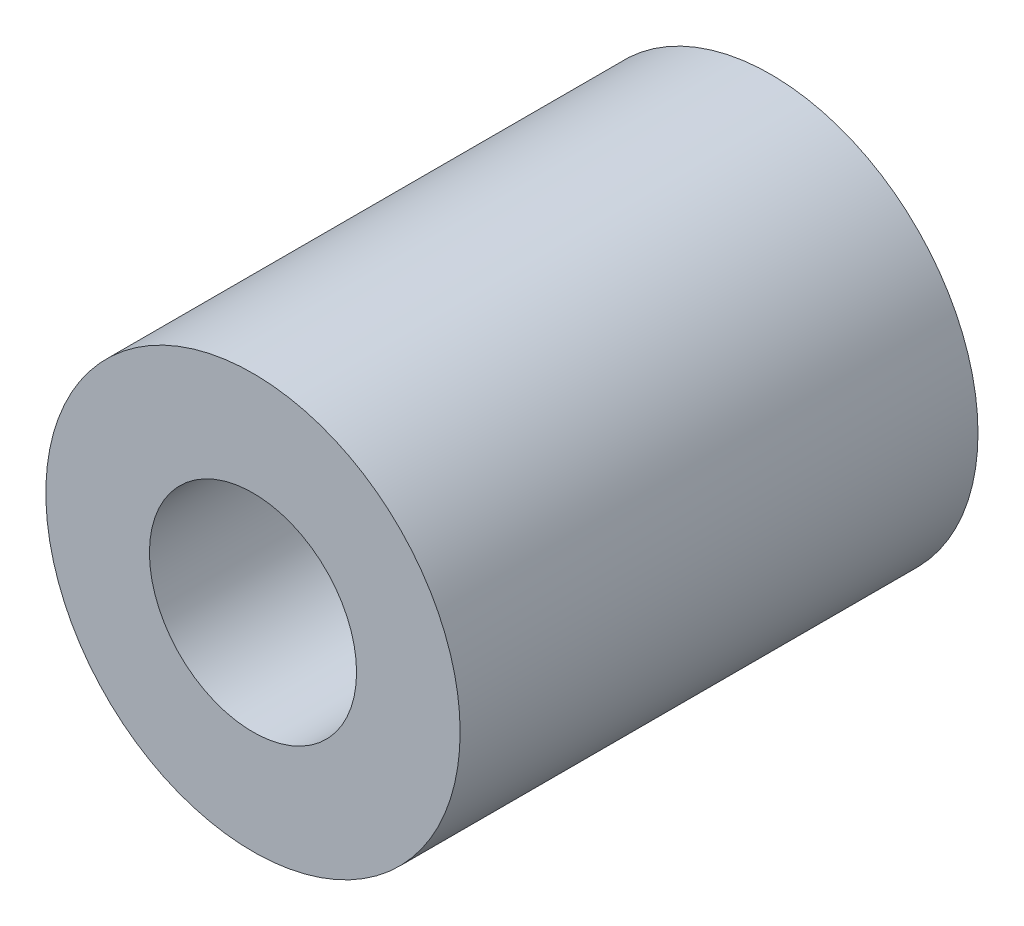
ISO-10303-21;
HEADER;
FILE_DESCRIPTION(('STEP AP214'),'2;1');
FILE_NAME('part.step','',(''),(''),'','','');
FILE_SCHEMA(('AUTOMOTIVE_DESIGN { 1 0 10303 214 1 1 1 1 }'));
ENDSEC;
DATA;
#1=APPLICATION_CONTEXT('core data for automotive mechanical design processes');
#2=APPLICATION_PROTOCOL_DEFINITION('international standard','automotive_design',2000,#1);
#3=PRODUCT_CONTEXT('',#1,'mechanical');
#4=PRODUCT('Part','Part','',(#3));
#5=PRODUCT_RELATED_PRODUCT_CATEGORY('part','',(#4));
#6=PRODUCT_DEFINITION_FORMATION('','',#4);
#7=PRODUCT_DEFINITION_CONTEXT('part definition',#1,'design');
#8=PRODUCT_DEFINITION('design','',#6,#7);
#9=PRODUCT_DEFINITION_SHAPE('','',#8);
#10=(LENGTH_UNIT() NAMED_UNIT(*) SI_UNIT(.MILLI.,.METRE.));
#11=(NAMED_UNIT(*) PLANE_ANGLE_UNIT() SI_UNIT($,.RADIAN.));
#12=(NAMED_UNIT(*) SI_UNIT($,.STERADIAN.) SOLID_ANGLE_UNIT());
#13=UNCERTAINTY_MEASURE_WITH_UNIT(LENGTH_MEASURE(1.E-05),#10,'distance_accuracy_value','');
#14=(GEOMETRIC_REPRESENTATION_CONTEXT(3) GLOBAL_UNCERTAINTY_ASSIGNED_CONTEXT((#13)) GLOBAL_UNIT_ASSIGNED_CONTEXT((#10,
#11,#12)) REPRESENTATION_CONTEXT('',''));
#15=CARTESIAN_POINT('',(0.,0.,0.));
#16=DIRECTION('',(0.,0.,1.));
#17=DIRECTION('',(1.,0.,0.));
#18=AXIS2_PLACEMENT_3D('',#15,#16,#17);
#19=CARTESIAN_POINT('',(0.,0.,30.));
#20=DIRECTION('',(0.,0.,1.));
#21=DIRECTION('',(1.,0.,0.));
#22=AXIS2_PLACEMENT_3D('',#19,#20,#21);
#23=PLANE('',#22);
#24=CARTESIAN_POINT('',(0.,0.,30.));
#25=DIRECTION('',(0.,0.,1.));
#26=DIRECTION('',(1.,0.,0.));
#27=AXIS2_PLACEMENT_3D('',#24,#25,#26);
#28=CIRCLE('',#27,12.);
#29=CARTESIAN_POINT('',(12.,0.,30.));
#30=VERTEX_POINT('',#29);
#31=EDGE_CURVE('E10',#30,#30,#28,.T.);
#32=ORIENTED_EDGE('',*,*,#31,.T.);
#33=EDGE_LOOP('',(#32));
#34=FACE_BOUND('',#33,.T.);
#35=CARTESIAN_POINT('',(0.,0.,30.));
#36=DIRECTION('',(0.,0.,1.));
#37=DIRECTION('',(1.,0.,0.));
#38=AXIS2_PLACEMENT_3D('',#35,#36,#37);
#39=CIRCLE('',#38,6.00000000000004);
#40=CARTESIAN_POINT('',(6.00000000000002,0.,30.));
#41=VERTEX_POINT('',#40);
#42=EDGE_CURVE('E46',#41,#41,#39,.T.);
#43=ORIENTED_EDGE('',*,*,#42,.F.);
#44=EDGE_LOOP('',(#43));
#45=FACE_BOUND('',#44,.T.);
#46=ADVANCED_FACE('F35',(#34,#45),#23,.T.);
#47=CARTESIAN_POINT('',(0.,0.,0.));
#48=DIRECTION('',(0.,0.,1.));
#49=DIRECTION('',(1.,0.,0.));
#50=AXIS2_PLACEMENT_3D('',#47,#48,#49);
#51=PLANE('',#50);
#52=CARTESIAN_POINT('',(0.,0.,0.));
#53=DIRECTION('',(0.,0.,1.));
#54=DIRECTION('',(1.,0.,0.));
#55=AXIS2_PLACEMENT_3D('',#52,#53,#54);
#56=CIRCLE('',#55,12.);
#57=CARTESIAN_POINT('',(12.,0.,0.));
#58=VERTEX_POINT('',#57);
#59=EDGE_CURVE('E39',#58,#58,#56,.T.);
#60=ORIENTED_EDGE('',*,*,#59,.F.);
#61=EDGE_LOOP('',(#60));
#62=FACE_BOUND('',#61,.T.);
#63=CARTESIAN_POINT('',(0.,0.,0.));
#64=DIRECTION('',(0.,0.,1.));
#65=DIRECTION('',(1.,0.,0.));
#66=AXIS2_PLACEMENT_3D('',#63,#64,#65);
#67=CIRCLE('',#66,6.00000000000004);
#68=CARTESIAN_POINT('',(6.00000000000002,0.,0.));
#69=VERTEX_POINT('',#68);
#70=EDGE_CURVE('E48',#69,#69,#67,.T.);
#71=ORIENTED_EDGE('',*,*,#70,.T.);
#72=EDGE_LOOP('',(#71));
#73=FACE_BOUND('',#72,.T.);
#74=ADVANCED_FACE('F58',(#62,#73),#51,.F.);
#75=CARTESIAN_POINT('',(0.,0.,30.));
#76=DIRECTION('',(0.,0.,-1.));
#77=DIRECTION('',(-1.,0.,0.));
#78=AXIS2_PLACEMENT_3D('',#75,#76,#77);
#79=CYLINDRICAL_SURFACE('',#78,12.);
#80=ORIENTED_EDGE('',*,*,#59,.T.);
#81=EDGE_LOOP('',(#80));
#82=FACE_BOUND('',#81,.T.);
#83=ORIENTED_EDGE('',*,*,#31,.F.);
#84=EDGE_LOOP('',(#83));
#85=FACE_BOUND('',#84,.T.);
#86=ADVANCED_FACE('F37',(#82,#85),#79,.T.);
#87=CARTESIAN_POINT('',(0.,0.,30.));
#88=DIRECTION('',(0.,0.,-1.));
#89=DIRECTION('',(-1.,0.,0.));
#90=AXIS2_PLACEMENT_3D('',#87,#88,#89);
#91=CYLINDRICAL_SURFACE('',#90,6.00000000000004);
#92=ORIENTED_EDGE('',*,*,#42,.T.);
#93=EDGE_LOOP('',(#92));
#94=FACE_BOUND('',#93,.T.);
#95=ORIENTED_EDGE('',*,*,#70,.F.);
#96=EDGE_LOOP('',(#95));
#97=FACE_BOUND('',#96,.T.);
#98=ADVANCED_FACE('F54',(#94,#97),#91,.F.);
#99=CLOSED_SHELL('',(#46,#74,#86,#98));
#100=MANIFOLD_SOLID_BREP('B2',#99);
#101=ADVANCED_BREP_SHAPE_REPRESENTATION('',(#18,#100),#14);
#102=SHAPE_DEFINITION_REPRESENTATION(#9,#101);
ENDSEC;
END-ISO-10303-21;
